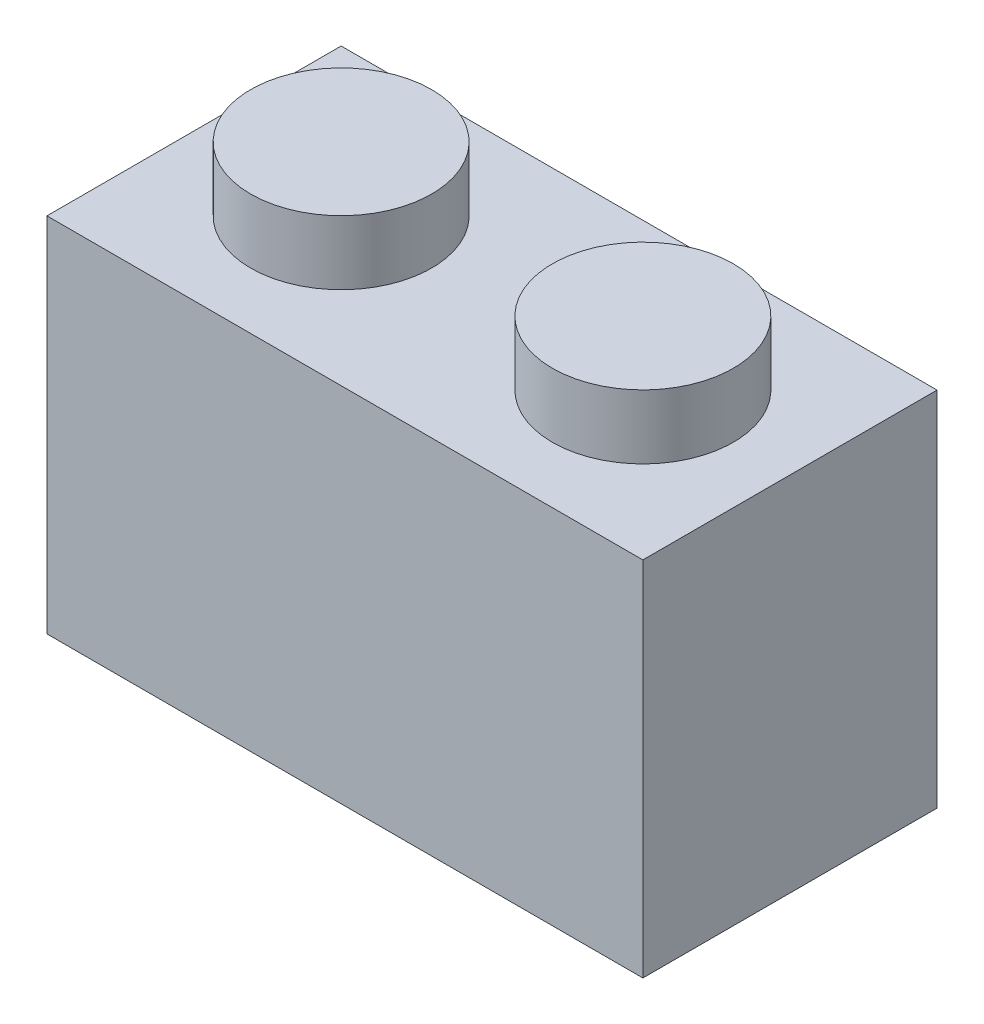
ISO-10303-21;
HEADER;
FILE_DESCRIPTION(('STEP AP214'),'2;1');
FILE_NAME('part.step','',(''),(''),'','','');
FILE_SCHEMA(('AUTOMOTIVE_DESIGN { 1 0 10303 214 1 1 1 1 }'));
ENDSEC;
DATA;
#1=APPLICATION_CONTEXT('core data for automotive mechanical design processes');
#2=APPLICATION_PROTOCOL_DEFINITION('international standard','automotive_design',2000,#1);
#3=PRODUCT_CONTEXT('',#1,'mechanical');
#4=PRODUCT('Part','Part','',(#3));
#5=PRODUCT_RELATED_PRODUCT_CATEGORY('part','',(#4));
#6=PRODUCT_DEFINITION_FORMATION('','',#4);
#7=PRODUCT_DEFINITION_CONTEXT('part definition',#1,'design');
#8=PRODUCT_DEFINITION('design','',#6,#7);
#9=PRODUCT_DEFINITION_SHAPE('','',#8);
#10=(LENGTH_UNIT() NAMED_UNIT(*) SI_UNIT(.MILLI.,.METRE.));
#11=(NAMED_UNIT(*) PLANE_ANGLE_UNIT() SI_UNIT($,.RADIAN.));
#12=(NAMED_UNIT(*) SI_UNIT($,.STERADIAN.) SOLID_ANGLE_UNIT());
#13=UNCERTAINTY_MEASURE_WITH_UNIT(LENGTH_MEASURE(1.E-05),#10,'distance_accuracy_value','');
#14=(GEOMETRIC_REPRESENTATION_CONTEXT(3) GLOBAL_UNCERTAINTY_ASSIGNED_CONTEXT((#13)) GLOBAL_UNIT_ASSIGNED_CONTEXT((#10,
#11,#12)) REPRESENTATION_CONTEXT('',''));
#15=CARTESIAN_POINT('',(0.,0.,0.));
#16=DIRECTION('',(0.,0.,1.));
#17=DIRECTION('',(1.,0.,0.));
#18=AXIS2_PLACEMENT_3D('',#15,#16,#17);
#19=CARTESIAN_POINT('',(0.,9.6,-7.8));
#20=DIRECTION('',(0.,0.,-1.));
#21=DIRECTION('',(-1.,0.,0.));
#22=AXIS2_PLACEMENT_3D('',#19,#20,#21);
#23=PLANE('',#22);
#24=DIRECTION('',(1.,0.,0.));
#25=VECTOR('',#24,1.);
#26=CARTESIAN_POINT('',(0.,0.,-7.8));
#27=LINE('',#26,#25);
#28=CARTESIAN_POINT('',(0.,0.,-7.8));
#29=VERTEX_POINT('',#28);
#30=CARTESIAN_POINT('',(15.8,0.,-7.8));
#31=VERTEX_POINT('',#30);
#32=EDGE_CURVE('E99',#29,#31,#27,.T.);
#33=ORIENTED_EDGE('',*,*,#32,.F.);
#34=DIRECTION('',(0.,-1.,0.));
#35=VECTOR('',#34,1.);
#36=CARTESIAN_POINT('',(0.,9.6,-7.8));
#37=LINE('',#36,#35);
#38=CARTESIAN_POINT('',(0.,9.6,-7.8));
#39=VERTEX_POINT('',#38);
#40=EDGE_CURVE('E11',#39,#29,#37,.T.);
#41=ORIENTED_EDGE('',*,*,#40,.F.);
#42=DIRECTION('',(1.,0.,0.));
#43=VECTOR('',#42,1.);
#44=CARTESIAN_POINT('',(0.,9.6,-7.8));
#45=LINE('',#44,#43);
#46=CARTESIAN_POINT('',(15.8,9.6,-7.8));
#47=VERTEX_POINT('',#46);
#48=EDGE_CURVE('E92',#39,#47,#45,.T.);
#49=ORIENTED_EDGE('',*,*,#48,.T.);
#50=DIRECTION('',(0.,-1.,0.));
#51=VECTOR('',#50,1.);
#52=CARTESIAN_POINT('',(15.8,9.6,-7.8));
#53=LINE('',#52,#51);
#54=EDGE_CURVE('E37',#47,#31,#53,.T.);
#55=ORIENTED_EDGE('',*,*,#54,.T.);
#56=EDGE_LOOP('',(#33,#41,#49,#55));
#57=FACE_BOUND('',#56,.T.);
#58=ADVANCED_FACE('F34',(#57),#23,.T.);
#59=CARTESIAN_POINT('',(0.,9.6,0.));
#60=DIRECTION('',(-1.,0.,0.));
#61=DIRECTION('',(0.,0.,1.));
#62=AXIS2_PLACEMENT_3D('',#59,#60,#61);
#63=PLANE('',#62);
#64=DIRECTION('',(0.,0.,-1.));
#65=VECTOR('',#64,1.);
#66=CARTESIAN_POINT('',(0.,0.,0.));
#67=LINE('',#66,#65);
#68=CARTESIAN_POINT('',(0.,0.,0.));
#69=VERTEX_POINT('',#68);
#70=EDGE_CURVE('E94',#69,#29,#67,.T.);
#71=ORIENTED_EDGE('',*,*,#70,.F.);
#72=DIRECTION('',(0.,-1.,0.));
#73=VECTOR('',#72,1.);
#74=CARTESIAN_POINT('',(0.,9.6,0.));
#75=LINE('',#74,#73);
#76=CARTESIAN_POINT('',(0.,9.6,0.));
#77=VERTEX_POINT('',#76);
#78=EDGE_CURVE('E43',#77,#69,#75,.T.);
#79=ORIENTED_EDGE('',*,*,#78,.F.);
#80=DIRECTION('',(0.,0.,-1.));
#81=VECTOR('',#80,1.);
#82=CARTESIAN_POINT('',(0.,9.6,0.));
#83=LINE('',#82,#81);
#84=EDGE_CURVE('E82',#77,#39,#83,.T.);
#85=ORIENTED_EDGE('',*,*,#84,.T.);
#86=ORIENTED_EDGE('',*,*,#40,.T.);
#87=EDGE_LOOP('',(#71,#79,#85,#86));
#88=FACE_BOUND('',#87,.T.);
#89=ADVANCED_FACE('F110',(#88),#63,.T.);
#90=CARTESIAN_POINT('',(0.,9.6,0.));
#91=DIRECTION('',(0.,0.,-1.));
#92=DIRECTION('',(-1.,0.,0.));
#93=AXIS2_PLACEMENT_3D('',#90,#91,#92);
#94=PLANE('',#93);
#95=DIRECTION('',(1.,0.,0.));
#96=VECTOR('',#95,1.);
#97=CARTESIAN_POINT('',(0.,0.,0.));
#98=LINE('',#97,#96);
#99=CARTESIAN_POINT('',(15.8,0.,0.));
#100=VERTEX_POINT('',#99);
#101=EDGE_CURVE('E87',#69,#100,#98,.T.);
#102=ORIENTED_EDGE('',*,*,#101,.T.);
#103=DIRECTION('',(0.,-1.,0.));
#104=VECTOR('',#103,1.);
#105=CARTESIAN_POINT('',(15.8,9.6,0.));
#106=LINE('',#105,#104);
#107=CARTESIAN_POINT('',(15.8,9.6,0.));
#108=VERTEX_POINT('',#107);
#109=EDGE_CURVE('E85',#108,#100,#106,.T.);
#110=ORIENTED_EDGE('',*,*,#109,.F.);
#111=DIRECTION('',(1.,0.,0.));
#112=VECTOR('',#111,1.);
#113=CARTESIAN_POINT('',(0.,9.6,0.));
#114=LINE('',#113,#112);
#115=EDGE_CURVE('E79',#77,#108,#114,.T.);
#116=ORIENTED_EDGE('',*,*,#115,.F.);
#117=ORIENTED_EDGE('',*,*,#78,.T.);
#118=EDGE_LOOP('',(#102,#110,#116,#117));
#119=FACE_BOUND('',#118,.T.);
#120=ADVANCED_FACE('F86',(#119),#94,.F.);
#121=CARTESIAN_POINT('',(15.8,9.6,0.));
#122=DIRECTION('',(-1.,0.,0.));
#123=DIRECTION('',(0.,0.,1.));
#124=AXIS2_PLACEMENT_3D('',#121,#122,#123);
#125=PLANE('',#124);
#126=DIRECTION('',(0.,0.,-1.));
#127=VECTOR('',#126,1.);
#128=CARTESIAN_POINT('',(15.8,0.,0.));
#129=LINE('',#128,#127);
#130=EDGE_CURVE('E102',#100,#31,#129,.T.);
#131=ORIENTED_EDGE('',*,*,#130,.T.);
#132=ORIENTED_EDGE('',*,*,#54,.F.);
#133=DIRECTION('',(0.,0.,-1.));
#134=VECTOR('',#133,1.);
#135=CARTESIAN_POINT('',(15.8,9.6,0.));
#136=LINE('',#135,#134);
#137=EDGE_CURVE('E76',#108,#47,#136,.T.);
#138=ORIENTED_EDGE('',*,*,#137,.F.);
#139=ORIENTED_EDGE('',*,*,#109,.T.);
#140=EDGE_LOOP('',(#131,#132,#138,#139));
#141=FACE_BOUND('',#140,.T.);
#142=ADVANCED_FACE('F91',(#141),#125,.F.);
#143=CARTESIAN_POINT('',(0.,9.6,0.));
#144=DIRECTION('',(0.,1.,0.));
#145=DIRECTION('',(0.,0.,1.));
#146=AXIS2_PLACEMENT_3D('',#143,#144,#145);
#147=PLANE('',#146);
#148=CARTESIAN_POINT('',(11.9,9.6,-3.9));
#149=DIRECTION('',(0.,1.,0.));
#150=DIRECTION('',(0.,0.,1.));
#151=AXIS2_PLACEMENT_3D('',#148,#149,#150);
#152=CIRCLE('',#151,2.4);
#153=CARTESIAN_POINT('',(11.9,9.6,-1.5));
#154=VERTEX_POINT('',#153);
#155=EDGE_CURVE('E168',#154,#154,#152,.T.);
#156=ORIENTED_EDGE('',*,*,#155,.F.);
#157=EDGE_LOOP('',(#156));
#158=FACE_BOUND('',#157,.T.);
#159=CARTESIAN_POINT('',(3.9,9.6,-3.9));
#160=DIRECTION('',(0.,1.,0.));
#161=DIRECTION('',(0.,0.,1.));
#162=AXIS2_PLACEMENT_3D('',#159,#160,#161);
#163=CIRCLE('',#162,2.4);
#164=CARTESIAN_POINT('',(3.9,9.6,-1.5));
#165=VERTEX_POINT('',#164);
#166=EDGE_CURVE('E184',#165,#165,#163,.T.);
#167=ORIENTED_EDGE('',*,*,#166,.F.);
#168=EDGE_LOOP('',(#167));
#169=FACE_BOUND('',#168,.T.);
#170=ORIENTED_EDGE('',*,*,#48,.F.);
#171=ORIENTED_EDGE('',*,*,#84,.F.);
#172=ORIENTED_EDGE('',*,*,#115,.T.);
#173=ORIENTED_EDGE('',*,*,#137,.T.);
#174=EDGE_LOOP('',(#170,#171,#172,#173));
#175=FACE_BOUND('',#174,.T.);
#176=ADVANCED_FACE('F81',(#158,#169,#175),#147,.T.);
#177=CARTESIAN_POINT('',(0.,0.,0.));
#178=DIRECTION('',(0.,1.,0.));
#179=DIRECTION('',(0.,0.,1.));
#180=AXIS2_PLACEMENT_3D('',#177,#178,#179);
#181=PLANE('',#180);
#182=CARTESIAN_POINT('',(11.9,0.,-3.9));
#183=DIRECTION('',(0.,-1.,0.));
#184=DIRECTION('',(0.,0.,-1.));
#185=AXIS2_PLACEMENT_3D('',#182,#183,#184);
#186=CIRCLE('',#185,2.5);
#187=CARTESIAN_POINT('',(11.9,0.,-6.4));
#188=VERTEX_POINT('',#187);
#189=EDGE_CURVE('E169',#188,#188,#186,.T.);
#190=ORIENTED_EDGE('',*,*,#189,.F.);
#191=EDGE_LOOP('',(#190));
#192=FACE_BOUND('',#191,.T.);
#193=CARTESIAN_POINT('',(3.9,0.,-3.90000000000006));
#194=DIRECTION('',(0.,-1.,0.));
#195=DIRECTION('',(0.,0.,-1.));
#196=AXIS2_PLACEMENT_3D('',#193,#194,#195);
#197=CIRCLE('',#196,2.5);
#198=CARTESIAN_POINT('',(3.9,0.,-6.40000000000006));
#199=VERTEX_POINT('',#198);
#200=EDGE_CURVE('E180',#199,#199,#197,.T.);
#201=ORIENTED_EDGE('',*,*,#200,.F.);
#202=EDGE_LOOP('',(#201));
#203=FACE_BOUND('',#202,.T.);
#204=ORIENTED_EDGE('',*,*,#32,.T.);
#205=ORIENTED_EDGE('',*,*,#130,.F.);
#206=ORIENTED_EDGE('',*,*,#101,.F.);
#207=ORIENTED_EDGE('',*,*,#70,.T.);
#208=EDGE_LOOP('',(#204,#205,#206,#207));
#209=FACE_BOUND('',#208,.T.);
#210=ADVANCED_FACE('F109',(#192,#203,#209),#181,.F.);
#211=CARTESIAN_POINT('',(3.9,11.3,-3.9));
#212=DIRECTION('',(0.,-1.,0.));
#213=DIRECTION('',(0.,0.,-1.));
#214=AXIS2_PLACEMENT_3D('',#211,#212,#213);
#215=CYLINDRICAL_SURFACE('',#214,2.4);
#216=CARTESIAN_POINT('',(3.9,11.3,-3.9));
#217=DIRECTION('',(0.,1.,0.));
#218=DIRECTION('',(0.,0.,1.));
#219=AXIS2_PLACEMENT_3D('',#216,#217,#218);
#220=CIRCLE('',#219,2.4);
#221=CARTESIAN_POINT('',(3.9,11.3,-1.5));
#222=VERTEX_POINT('',#221);
#223=EDGE_CURVE('E103',#222,#222,#220,.T.);
#224=ORIENTED_EDGE('',*,*,#223,.F.);
#225=EDGE_LOOP('',(#224));
#226=FACE_BOUND('',#225,.T.);
#227=ORIENTED_EDGE('',*,*,#166,.T.);
#228=EDGE_LOOP('',(#227));
#229=FACE_BOUND('',#228,.T.);
#230=ADVANCED_FACE('F128',(#226,#229),#215,.T.);
#231=CARTESIAN_POINT('',(3.9,11.3,-3.9));
#232=DIRECTION('',(0.,1.,0.));
#233=DIRECTION('',(0.,0.,1.));
#234=AXIS2_PLACEMENT_3D('',#231,#232,#233);
#235=PLANE('',#234);
#236=ORIENTED_EDGE('',*,*,#223,.T.);
#237=EDGE_LOOP('',(#236));
#238=FACE_BOUND('',#237,.T.);
#239=ADVANCED_FACE('F135',(#238),#235,.T.);
#240=CARTESIAN_POINT('',(11.9,11.3,-3.9));
#241=DIRECTION('',(0.,-1.,0.));
#242=DIRECTION('',(0.,0.,-1.));
#243=AXIS2_PLACEMENT_3D('',#240,#241,#242);
#244=CYLINDRICAL_SURFACE('',#243,2.4);
#245=CARTESIAN_POINT('',(11.9,11.3,-3.9));
#246=DIRECTION('',(0.,1.,0.));
#247=DIRECTION('',(0.,0.,1.));
#248=AXIS2_PLACEMENT_3D('',#245,#246,#247);
#249=CIRCLE('',#248,2.4);
#250=CARTESIAN_POINT('',(11.9,11.3,-1.5));
#251=VERTEX_POINT('',#250);
#252=EDGE_CURVE('E172',#251,#251,#249,.T.);
#253=ORIENTED_EDGE('',*,*,#252,.F.);
#254=EDGE_LOOP('',(#253));
#255=FACE_BOUND('',#254,.T.);
#256=ORIENTED_EDGE('',*,*,#155,.T.);
#257=EDGE_LOOP('',(#256));
#258=FACE_BOUND('',#257,.T.);
#259=ADVANCED_FACE('F139',(#255,#258),#244,.T.);
#260=CARTESIAN_POINT('',(11.9,11.3,-3.9));
#261=DIRECTION('',(0.,1.,0.));
#262=DIRECTION('',(0.,0.,1.));
#263=AXIS2_PLACEMENT_3D('',#260,#261,#262);
#264=PLANE('',#263);
#265=ORIENTED_EDGE('',*,*,#252,.T.);
#266=EDGE_LOOP('',(#265));
#267=FACE_BOUND('',#266,.T.);
#268=ADVANCED_FACE('F143',(#267),#264,.T.);
#269=CARTESIAN_POINT('',(3.9,1.8,-3.90000000000006));
#270=DIRECTION('',(0.,-1.,0.));
#271=DIRECTION('',(0.,0.,-1.));
#272=AXIS2_PLACEMENT_3D('',#269,#270,#271);
#273=CYLINDRICAL_SURFACE('',#272,2.5);
#274=CARTESIAN_POINT('',(3.9,1.8,-3.90000000000006));
#275=DIRECTION('',(0.,-1.,0.));
#276=DIRECTION('',(0.,0.,-1.));
#277=AXIS2_PLACEMENT_3D('',#274,#275,#276);
#278=CIRCLE('',#277,2.5);
#279=CARTESIAN_POINT('',(3.9,1.8,-6.40000000000006));
#280=VERTEX_POINT('',#279);
#281=EDGE_CURVE('E175',#280,#280,#278,.T.);
#282=ORIENTED_EDGE('',*,*,#281,.F.);
#283=EDGE_LOOP('',(#282));
#284=FACE_BOUND('',#283,.T.);
#285=ORIENTED_EDGE('',*,*,#200,.T.);
#286=EDGE_LOOP('',(#285));
#287=FACE_BOUND('',#286,.T.);
#288=ADVANCED_FACE('F147',(#284,#287),#273,.F.);
#289=CARTESIAN_POINT('',(3.9,1.8,-3.90000000000006));
#290=DIRECTION('',(0.,-1.,0.));
#291=DIRECTION('',(0.,0.,-1.));
#292=AXIS2_PLACEMENT_3D('',#289,#290,#291);
#293=PLANE('',#292);
#294=ORIENTED_EDGE('',*,*,#281,.T.);
#295=EDGE_LOOP('',(#294));
#296=FACE_BOUND('',#295,.T.);
#297=ADVANCED_FACE('F151',(#296),#293,.T.);
#298=CARTESIAN_POINT('',(11.9,1.8,-3.9));
#299=DIRECTION('',(0.,-1.,0.));
#300=DIRECTION('',(0.,0.,-1.));
#301=AXIS2_PLACEMENT_3D('',#298,#299,#300);
#302=CYLINDRICAL_SURFACE('',#301,2.5);
#303=CARTESIAN_POINT('',(11.9,1.8,-3.9));
#304=DIRECTION('',(0.,-1.,0.));
#305=DIRECTION('',(0.,0.,-1.));
#306=AXIS2_PLACEMENT_3D('',#303,#304,#305);
#307=CIRCLE('',#306,2.5);
#308=CARTESIAN_POINT('',(11.9,1.8,-6.4));
#309=VERTEX_POINT('',#308);
#310=EDGE_CURVE('E167',#309,#309,#307,.T.);
#311=ORIENTED_EDGE('',*,*,#310,.F.);
#312=EDGE_LOOP('',(#311));
#313=FACE_BOUND('',#312,.T.);
#314=ORIENTED_EDGE('',*,*,#189,.T.);
#315=EDGE_LOOP('',(#314));
#316=FACE_BOUND('',#315,.T.);
#317=ADVANCED_FACE('F155',(#313,#316),#302,.F.);
#318=CARTESIAN_POINT('',(11.9,1.8,-3.9));
#319=DIRECTION('',(0.,-1.,0.));
#320=DIRECTION('',(0.,0.,-1.));
#321=AXIS2_PLACEMENT_3D('',#318,#319,#320);
#322=PLANE('',#321);
#323=ORIENTED_EDGE('',*,*,#310,.T.);
#324=EDGE_LOOP('',(#323));
#325=FACE_BOUND('',#324,.T.);
#326=ADVANCED_FACE('F159',(#325),#322,.T.);
#327=CLOSED_SHELL('',(#58,#89,#120,#142,#176,#210,#230,#239,#259,#268,#288,#297,#317,#326));
#328=MANIFOLD_SOLID_BREP('B2',#327);
#329=ADVANCED_BREP_SHAPE_REPRESENTATION('',(#18,#328),#14);
#330=SHAPE_DEFINITION_REPRESENTATION(#9,#329);
ENDSEC;
END-ISO-10303-21;
